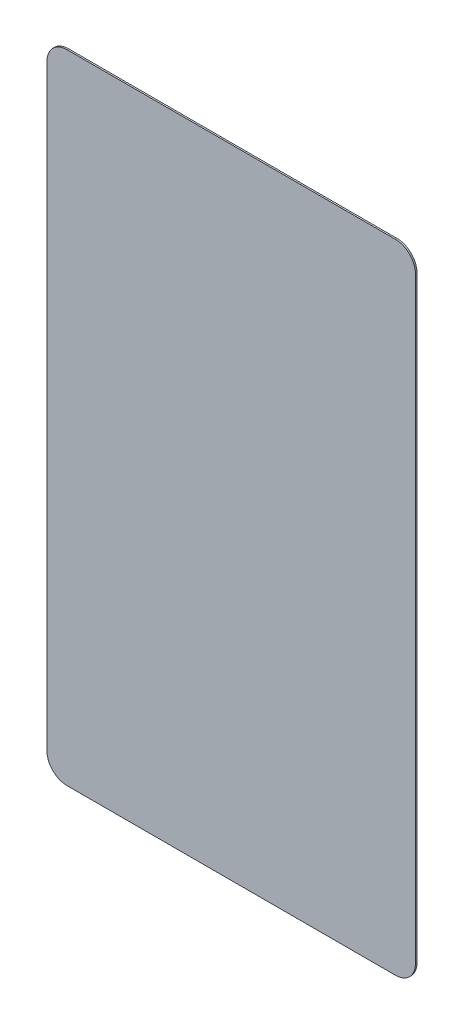
ISO-10303-21;
HEADER;
FILE_DESCRIPTION(('STEP AP214'),'2;1');
FILE_NAME('part.step','',(''),(''),'','','');
FILE_SCHEMA(('AUTOMOTIVE_DESIGN { 1 0 10303 214 1 1 1 1 }'));
ENDSEC;
DATA;
#1=APPLICATION_CONTEXT('core data for automotive mechanical design processes');
#2=APPLICATION_PROTOCOL_DEFINITION('international standard','automotive_design',2000,#1);
#3=PRODUCT_CONTEXT('',#1,'mechanical');
#4=PRODUCT('Part','Part','',(#3));
#5=PRODUCT_RELATED_PRODUCT_CATEGORY('part','',(#4));
#6=PRODUCT_DEFINITION_FORMATION('','',#4);
#7=PRODUCT_DEFINITION_CONTEXT('part definition',#1,'design');
#8=PRODUCT_DEFINITION('design','',#6,#7);
#9=PRODUCT_DEFINITION_SHAPE('','',#8);
#10=(LENGTH_UNIT() NAMED_UNIT(*) SI_UNIT(.MILLI.,.METRE.));
#11=(NAMED_UNIT(*) PLANE_ANGLE_UNIT() SI_UNIT($,.RADIAN.));
#12=(NAMED_UNIT(*) SI_UNIT($,.STERADIAN.) SOLID_ANGLE_UNIT());
#13=UNCERTAINTY_MEASURE_WITH_UNIT(LENGTH_MEASURE(1.E-05),#10,'distance_accuracy_value','');
#14=(GEOMETRIC_REPRESENTATION_CONTEXT(3) GLOBAL_UNCERTAINTY_ASSIGNED_CONTEXT((#13)) GLOBAL_UNIT_ASSIGNED_CONTEXT((#10,
#11,#12)) REPRESENTATION_CONTEXT('',''));
#15=CARTESIAN_POINT('',(0.,0.,0.));
#16=DIRECTION('',(0.,0.,1.));
#17=DIRECTION('',(1.,0.,0.));
#18=AXIS2_PLACEMENT_3D('',#15,#16,#17);
#19=CARTESIAN_POINT('',(-26.19375,3.175,-0.254));
#20=DIRECTION('',(0.,0.,1.));
#21=DIRECTION('',(1.,0.,0.));
#22=AXIS2_PLACEMENT_3D('',#19,#20,#21);
#23=CYLINDRICAL_SURFACE('',#22,3.175);
#24=CARTESIAN_POINT('',(-26.19375,3.175,0.));
#25=DIRECTION('',(0.,0.,1.));
#26=DIRECTION('',(1.,0.,0.));
#27=AXIS2_PLACEMENT_3D('',#24,#25,#26);
#28=CIRCLE('',#27,3.175);
#29=CARTESIAN_POINT('',(-29.36875,3.175,0.));
#30=VERTEX_POINT('',#29);
#31=CARTESIAN_POINT('',(-26.19375,0.,0.));
#32=VERTEX_POINT('',#31);
#33=EDGE_CURVE('E132',#30,#32,#28,.T.);
#34=ORIENTED_EDGE('',*,*,#33,.F.);
#35=DIRECTION('',(0.,0.,1.));
#36=VECTOR('',#35,1.);
#37=CARTESIAN_POINT('',(-29.36875,3.175,-0.254));
#38=LINE('',#37,#36);
#39=CARTESIAN_POINT('',(-29.36875,3.175,-0.254));
#40=VERTEX_POINT('',#39);
#41=EDGE_CURVE('E11',#40,#30,#38,.T.);
#42=ORIENTED_EDGE('',*,*,#41,.F.);
#43=CARTESIAN_POINT('',(-26.19375,3.175,-0.254));
#44=DIRECTION('',(0.,0.,1.));
#45=DIRECTION('',(1.,0.,0.));
#46=AXIS2_PLACEMENT_3D('',#43,#44,#45);
#47=CIRCLE('',#46,3.175);
#48=CARTESIAN_POINT('',(-26.19375,0.,-0.254));
#49=VERTEX_POINT('',#48);
#50=EDGE_CURVE('E152',#40,#49,#47,.T.);
#51=ORIENTED_EDGE('',*,*,#50,.T.);
#52=DIRECTION('',(0.,0.,1.));
#53=VECTOR('',#52,1.);
#54=CARTESIAN_POINT('',(-26.19375,0.,-0.254));
#55=LINE('',#54,#53);
#56=EDGE_CURVE('E38',#49,#32,#55,.T.);
#57=ORIENTED_EDGE('',*,*,#56,.T.);
#58=EDGE_LOOP('',(#34,#42,#51,#57));
#59=FACE_BOUND('',#58,.T.);
#60=ADVANCED_FACE('F35',(#59),#23,.T.);
#61=CARTESIAN_POINT('',(-29.36875,98.425,-0.254));
#62=DIRECTION('',(-1.,0.,0.));
#63=DIRECTION('',(0.,0.,1.));
#64=AXIS2_PLACEMENT_3D('',#61,#62,#63);
#65=PLANE('',#64);
#66=DIRECTION('',(0.,-1.,0.));
#67=VECTOR('',#66,1.);
#68=CARTESIAN_POINT('',(-29.36875,98.425,0.));
#69=LINE('',#68,#67);
#70=CARTESIAN_POINT('',(-29.36875,98.425,0.));
#71=VERTEX_POINT('',#70);
#72=EDGE_CURVE('E150',#71,#30,#69,.T.);
#73=ORIENTED_EDGE('',*,*,#72,.F.);
#74=DIRECTION('',(0.,0.,1.));
#75=VECTOR('',#74,1.);
#76=CARTESIAN_POINT('',(-29.36875,98.425,-0.254));
#77=LINE('',#76,#75);
#78=CARTESIAN_POINT('',(-29.36875,98.425,-0.254));
#79=VERTEX_POINT('',#78);
#80=EDGE_CURVE('E44',#79,#71,#77,.T.);
#81=ORIENTED_EDGE('',*,*,#80,.F.);
#82=DIRECTION('',(0.,-1.,0.));
#83=VECTOR('',#82,1.);
#84=CARTESIAN_POINT('',(-29.36875,98.425,-0.254));
#85=LINE('',#84,#83);
#86=EDGE_CURVE('E122',#79,#40,#85,.T.);
#87=ORIENTED_EDGE('',*,*,#86,.T.);
#88=ORIENTED_EDGE('',*,*,#41,.T.);
#89=EDGE_LOOP('',(#73,#81,#87,#88));
#90=FACE_BOUND('',#89,.T.);
#91=ADVANCED_FACE('F164',(#90),#65,.T.);
#92=CARTESIAN_POINT('',(-26.19375,98.425,-0.254));
#93=DIRECTION('',(0.,0.,1.));
#94=DIRECTION('',(1.,0.,0.));
#95=AXIS2_PLACEMENT_3D('',#92,#93,#94);
#96=CYLINDRICAL_SURFACE('',#95,3.17499999999999);
#97=CARTESIAN_POINT('',(-26.19375,98.425,0.));
#98=DIRECTION('',(0.,0.,1.));
#99=DIRECTION('',(1.,0.,0.));
#100=AXIS2_PLACEMENT_3D('',#97,#98,#99);
#101=CIRCLE('',#100,3.17499999999999);
#102=CARTESIAN_POINT('',(-26.19375,101.6,0.));
#103=VERTEX_POINT('',#102);
#104=EDGE_CURVE('E109',#103,#71,#101,.T.);
#105=ORIENTED_EDGE('',*,*,#104,.F.);
#106=DIRECTION('',(0.,0.,1.));
#107=VECTOR('',#106,1.);
#108=CARTESIAN_POINT('',(-26.19375,101.6,-0.254));
#109=LINE('',#108,#107);
#110=CARTESIAN_POINT('',(-26.19375,101.6,-0.254));
#111=VERTEX_POINT('',#110);
#112=EDGE_CURVE('E104',#111,#103,#109,.T.);
#113=ORIENTED_EDGE('',*,*,#112,.F.);
#114=CARTESIAN_POINT('',(-26.19375,98.425,-0.254));
#115=DIRECTION('',(0.,0.,1.));
#116=DIRECTION('',(1.,0.,0.));
#117=AXIS2_PLACEMENT_3D('',#114,#115,#116);
#118=CIRCLE('',#117,3.17499999999999);
#119=EDGE_CURVE('E107',#111,#79,#118,.T.);
#120=ORIENTED_EDGE('',*,*,#119,.T.);
#121=ORIENTED_EDGE('',*,*,#80,.T.);
#122=EDGE_LOOP('',(#105,#113,#120,#121));
#123=FACE_BOUND('',#122,.T.);
#124=ADVANCED_FACE('F106',(#123),#96,.T.);
#125=CARTESIAN_POINT('',(-26.19375,101.6,-0.254));
#126=DIRECTION('',(0.,1.,0.));
#127=DIRECTION('',(0.,0.,1.));
#128=AXIS2_PLACEMENT_3D('',#125,#126,#127);
#129=PLANE('',#128);
#130=DIRECTION('',(-1.,0.,0.));
#131=VECTOR('',#130,1.);
#132=CARTESIAN_POINT('',(-26.19375,101.6,0.));
#133=LINE('',#132,#131);
#134=CARTESIAN_POINT('',(26.19375,101.6,0.));
#135=VERTEX_POINT('',#134);
#136=EDGE_CURVE('E147',#135,#103,#133,.T.);
#137=ORIENTED_EDGE('',*,*,#136,.F.);
#138=DIRECTION('',(0.,0.,1.));
#139=VECTOR('',#138,1.);
#140=CARTESIAN_POINT('',(26.19375,101.6,-0.254));
#141=LINE('',#140,#139);
#142=CARTESIAN_POINT('',(26.19375,101.6,-0.254));
#143=VERTEX_POINT('',#142);
#144=EDGE_CURVE('E114',#143,#135,#141,.T.);
#145=ORIENTED_EDGE('',*,*,#144,.F.);
#146=DIRECTION('',(-1.,0.,0.));
#147=VECTOR('',#146,1.);
#148=CARTESIAN_POINT('',(-26.19375,101.6,-0.254));
#149=LINE('',#148,#147);
#150=EDGE_CURVE('E120',#143,#111,#149,.T.);
#151=ORIENTED_EDGE('',*,*,#150,.T.);
#152=ORIENTED_EDGE('',*,*,#112,.T.);
#153=EDGE_LOOP('',(#137,#145,#151,#152));
#154=FACE_BOUND('',#153,.T.);
#155=ADVANCED_FACE('F124',(#154),#129,.T.);
#156=CARTESIAN_POINT('',(26.19375,98.425,-0.254));
#157=DIRECTION('',(0.,0.,1.));
#158=DIRECTION('',(1.,0.,0.));
#159=AXIS2_PLACEMENT_3D('',#156,#157,#158);
#160=CYLINDRICAL_SURFACE('',#159,3.17499999999999);
#161=CARTESIAN_POINT('',(26.19375,98.425,0.));
#162=DIRECTION('',(0.,0.,1.));
#163=DIRECTION('',(1.,0.,0.));
#164=AXIS2_PLACEMENT_3D('',#161,#162,#163);
#165=CIRCLE('',#164,3.17499999999999);
#166=CARTESIAN_POINT('',(29.36875,98.425,0.));
#167=VERTEX_POINT('',#166);
#168=EDGE_CURVE('E144',#167,#135,#165,.T.);
#169=ORIENTED_EDGE('',*,*,#168,.F.);
#170=DIRECTION('',(0.,0.,1.));
#171=VECTOR('',#170,1.);
#172=CARTESIAN_POINT('',(29.36875,98.425,-0.254));
#173=LINE('',#172,#171);
#174=CARTESIAN_POINT('',(29.36875,98.425,-0.254));
#175=VERTEX_POINT('',#174);
#176=EDGE_CURVE('E156',#175,#167,#173,.T.);
#177=ORIENTED_EDGE('',*,*,#176,.F.);
#178=CARTESIAN_POINT('',(26.19375,98.425,-0.254));
#179=DIRECTION('',(0.,0.,1.));
#180=DIRECTION('',(1.,0.,0.));
#181=AXIS2_PLACEMENT_3D('',#178,#179,#180);
#182=CIRCLE('',#181,3.17499999999999);
#183=EDGE_CURVE('E125',#175,#143,#182,.T.);
#184=ORIENTED_EDGE('',*,*,#183,.T.);
#185=ORIENTED_EDGE('',*,*,#144,.T.);
#186=EDGE_LOOP('',(#169,#177,#184,#185));
#187=FACE_BOUND('',#186,.T.);
#188=ADVANCED_FACE('F177',(#187),#160,.T.);
#189=CARTESIAN_POINT('',(29.36875,98.425,-0.254));
#190=DIRECTION('',(1.,0.,0.));
#191=DIRECTION('',(0.,0.,-1.));
#192=AXIS2_PLACEMENT_3D('',#189,#190,#191);
#193=PLANE('',#192);
#194=DIRECTION('',(0.,1.,0.));
#195=VECTOR('',#194,1.);
#196=CARTESIAN_POINT('',(29.36875,98.425,0.));
#197=LINE('',#196,#195);
#198=CARTESIAN_POINT('',(29.36875,3.175,0.));
#199=VERTEX_POINT('',#198);
#200=EDGE_CURVE('E141',#199,#167,#197,.T.);
#201=ORIENTED_EDGE('',*,*,#200,.F.);
#202=DIRECTION('',(0.,0.,1.));
#203=VECTOR('',#202,1.);
#204=CARTESIAN_POINT('',(29.36875,3.175,-0.254));
#205=LINE('',#204,#203);
#206=CARTESIAN_POINT('',(29.36875,3.175,-0.254));
#207=VERTEX_POINT('',#206);
#208=EDGE_CURVE('E158',#207,#199,#205,.T.);
#209=ORIENTED_EDGE('',*,*,#208,.F.);
#210=DIRECTION('',(0.,1.,0.));
#211=VECTOR('',#210,1.);
#212=CARTESIAN_POINT('',(29.36875,98.425,-0.254));
#213=LINE('',#212,#211);
#214=EDGE_CURVE('E127',#207,#175,#213,.T.);
#215=ORIENTED_EDGE('',*,*,#214,.T.);
#216=ORIENTED_EDGE('',*,*,#176,.T.);
#217=EDGE_LOOP('',(#201,#209,#215,#216));
#218=FACE_BOUND('',#217,.T.);
#219=ADVANCED_FACE('F180',(#218),#193,.T.);
#220=CARTESIAN_POINT('',(26.19375,3.175,-0.254));
#221=DIRECTION('',(0.,0.,1.));
#222=DIRECTION('',(1.,0.,0.));
#223=AXIS2_PLACEMENT_3D('',#220,#221,#222);
#224=CYLINDRICAL_SURFACE('',#223,3.175);
#225=CARTESIAN_POINT('',(26.19375,3.175,0.));
#226=DIRECTION('',(0.,0.,1.));
#227=DIRECTION('',(1.,0.,0.));
#228=AXIS2_PLACEMENT_3D('',#225,#226,#227);
#229=CIRCLE('',#228,3.175);
#230=CARTESIAN_POINT('',(26.19375,0.,0.));
#231=VERTEX_POINT('',#230);
#232=EDGE_CURVE('E138',#231,#199,#229,.T.);
#233=ORIENTED_EDGE('',*,*,#232,.F.);
#234=DIRECTION('',(0.,0.,1.));
#235=VECTOR('',#234,1.);
#236=CARTESIAN_POINT('',(26.19375,0.,-0.254));
#237=LINE('',#236,#235);
#238=CARTESIAN_POINT('',(26.19375,0.,-0.254));
#239=VERTEX_POINT('',#238);
#240=EDGE_CURVE('E159',#239,#231,#237,.T.);
#241=ORIENTED_EDGE('',*,*,#240,.F.);
#242=CARTESIAN_POINT('',(26.19375,3.175,-0.254));
#243=DIRECTION('',(0.,0.,1.));
#244=DIRECTION('',(1.,0.,0.));
#245=AXIS2_PLACEMENT_3D('',#242,#243,#244);
#246=CIRCLE('',#245,3.175);
#247=EDGE_CURVE('E255',#239,#207,#246,.T.);
#248=ORIENTED_EDGE('',*,*,#247,.T.);
#249=ORIENTED_EDGE('',*,*,#208,.T.);
#250=EDGE_LOOP('',(#233,#241,#248,#249));
#251=FACE_BOUND('',#250,.T.);
#252=ADVANCED_FACE('F184',(#251),#224,.T.);
#253=CARTESIAN_POINT('',(-26.19375,0.,-0.254));
#254=DIRECTION('',(0.,-1.,0.));
#255=DIRECTION('',(0.,0.,-1.));
#256=AXIS2_PLACEMENT_3D('',#253,#254,#255);
#257=PLANE('',#256);
#258=DIRECTION('',(1.,0.,0.));
#259=VECTOR('',#258,1.);
#260=CARTESIAN_POINT('',(-26.19375,0.,0.));
#261=LINE('',#260,#259);
#262=EDGE_CURVE('E135',#32,#231,#261,.T.);
#263=ORIENTED_EDGE('',*,*,#262,.F.);
#264=ORIENTED_EDGE('',*,*,#56,.F.);
#265=DIRECTION('',(1.,0.,0.));
#266=VECTOR('',#265,1.);
#267=CARTESIAN_POINT('',(-26.19375,0.,-0.254));
#268=LINE('',#267,#266);
#269=EDGE_CURVE('E256',#49,#239,#268,.T.);
#270=ORIENTED_EDGE('',*,*,#269,.T.);
#271=ORIENTED_EDGE('',*,*,#240,.T.);
#272=EDGE_LOOP('',(#263,#264,#270,#271));
#273=FACE_BOUND('',#272,.T.);
#274=ADVANCED_FACE('F161',(#273),#257,.T.);
#275=CARTESIAN_POINT('',(-26.19375,3.175,-0.254));
#276=DIRECTION('',(0.,0.,1.));
#277=DIRECTION('',(1.,0.,0.));
#278=AXIS2_PLACEMENT_3D('',#275,#276,#277);
#279=PLANE('',#278);
#280=ORIENTED_EDGE('',*,*,#50,.F.);
#281=ORIENTED_EDGE('',*,*,#86,.F.);
#282=ORIENTED_EDGE('',*,*,#119,.F.);
#283=ORIENTED_EDGE('',*,*,#150,.F.);
#284=ORIENTED_EDGE('',*,*,#183,.F.);
#285=ORIENTED_EDGE('',*,*,#214,.F.);
#286=ORIENTED_EDGE('',*,*,#247,.F.);
#287=ORIENTED_EDGE('',*,*,#269,.F.);
#288=EDGE_LOOP('',(#280,#281,#282,#283,#284,#285,#286,#287));
#289=FACE_BOUND('',#288,.T.);
#290=ADVANCED_FACE('F118',(#289),#279,.F.);
#291=CARTESIAN_POINT('',(-26.19375,3.175,0.));
#292=DIRECTION('',(0.,0.,1.));
#293=DIRECTION('',(1.,0.,0.));
#294=AXIS2_PLACEMENT_3D('',#291,#292,#293);
#295=PLANE('',#294);
#296=ORIENTED_EDGE('',*,*,#33,.T.);
#297=ORIENTED_EDGE('',*,*,#262,.T.);
#298=ORIENTED_EDGE('',*,*,#232,.T.);
#299=ORIENTED_EDGE('',*,*,#200,.T.);
#300=ORIENTED_EDGE('',*,*,#168,.T.);
#301=ORIENTED_EDGE('',*,*,#136,.T.);
#302=ORIENTED_EDGE('',*,*,#104,.T.);
#303=ORIENTED_EDGE('',*,*,#72,.T.);
#304=EDGE_LOOP('',(#296,#297,#298,#299,#300,#301,#302,#303));
#305=FACE_BOUND('',#304,.T.);
#306=ADVANCED_FACE('F163',(#305),#295,.T.);
#307=CLOSED_SHELL('',(#60,#91,#124,#155,#188,#219,#252,#274,#290,#306));
#308=MANIFOLD_SOLID_BREP('B2',#307);
#309=ADVANCED_BREP_SHAPE_REPRESENTATION('',(#18,#308),#14);
#310=SHAPE_DEFINITION_REPRESENTATION(#9,#309);
ENDSEC;
END-ISO-10303-21;
